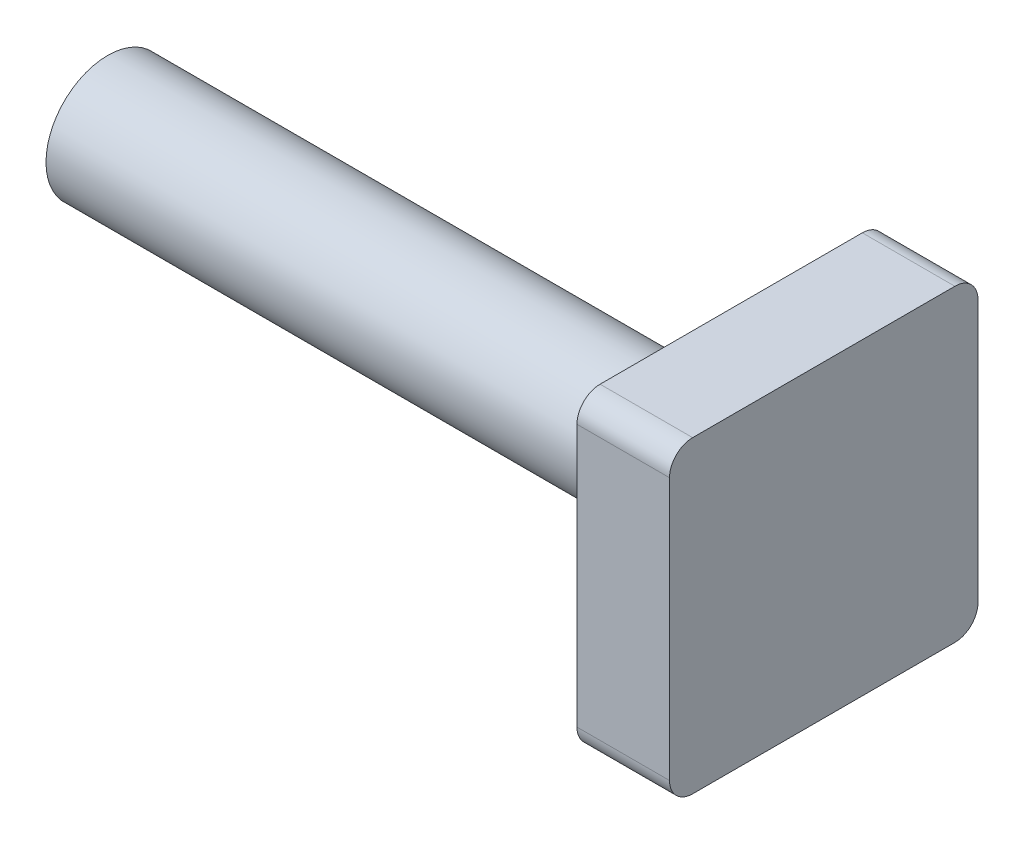
ISO-10303-21;
HEADER;
FILE_DESCRIPTION(('STEP AP214'),'2;1');
FILE_NAME('part.step','',(''),(''),'','','');
FILE_SCHEMA(('AUTOMOTIVE_DESIGN { 1 0 10303 214 1 1 1 1 }'));
ENDSEC;
DATA;
#1=APPLICATION_CONTEXT('core data for automotive mechanical design processes');
#2=APPLICATION_PROTOCOL_DEFINITION('international standard','automotive_design',2000,#1);
#3=PRODUCT_CONTEXT('',#1,'mechanical');
#4=PRODUCT('Part','Part','',(#3));
#5=PRODUCT_RELATED_PRODUCT_CATEGORY('part','',(#4));
#6=PRODUCT_DEFINITION_FORMATION('','',#4);
#7=PRODUCT_DEFINITION_CONTEXT('part definition',#1,'design');
#8=PRODUCT_DEFINITION('design','',#6,#7);
#9=PRODUCT_DEFINITION_SHAPE('','',#8);
#10=(LENGTH_UNIT() NAMED_UNIT(*) SI_UNIT(.MILLI.,.METRE.));
#11=(NAMED_UNIT(*) PLANE_ANGLE_UNIT() SI_UNIT($,.RADIAN.));
#12=(NAMED_UNIT(*) SI_UNIT($,.STERADIAN.) SOLID_ANGLE_UNIT());
#13=UNCERTAINTY_MEASURE_WITH_UNIT(LENGTH_MEASURE(1.E-05),#10,'distance_accuracy_value','');
#14=(GEOMETRIC_REPRESENTATION_CONTEXT(3) GLOBAL_UNCERTAINTY_ASSIGNED_CONTEXT((#13)) GLOBAL_UNIT_ASSIGNED_CONTEXT((#10,
#11,#12)) REPRESENTATION_CONTEXT('',''));
#15=CARTESIAN_POINT('',(0.,0.,0.));
#16=DIRECTION('',(0.,0.,1.));
#17=DIRECTION('',(1.,0.,0.));
#18=AXIS2_PLACEMENT_3D('',#15,#16,#17);
#19=CARTESIAN_POINT('',(0.,-5.,5.));
#20=DIRECTION('',(1.,0.,0.));
#21=DIRECTION('',(0.,0.,-1.));
#22=AXIS2_PLACEMENT_3D('',#19,#20,#21);
#23=PLANE('',#22);
#24=CARTESIAN_POINT('',(0.,0.,0.));
#25=DIRECTION('',(1.,0.,0.));
#26=DIRECTION('',(0.,0.,-1.));
#27=AXIS2_PLACEMENT_3D('',#24,#25,#26);
#28=CIRCLE('',#27,2.5);
#29=CARTESIAN_POINT('',(0.,0.,-2.5));
#30=VERTEX_POINT('',#29);
#31=EDGE_CURVE('E169',#30,#30,#28,.T.);
#32=ORIENTED_EDGE('',*,*,#31,.T.);
#33=EDGE_LOOP('',(#32));
#34=FACE_BOUND('',#33,.T.);
#35=DIRECTION('',(0.,0.,-1.));
#36=VECTOR('',#35,1.);
#37=CARTESIAN_POINT('',(0.,-5.,5.));
#38=LINE('',#37,#36);
#39=CARTESIAN_POINT('',(0.,-5.,4.25));
#40=VERTEX_POINT('',#39);
#41=CARTESIAN_POINT('',(0.,-5.,-4.25));
#42=VERTEX_POINT('',#41);
#43=EDGE_CURVE('E122',#40,#42,#38,.T.);
#44=ORIENTED_EDGE('',*,*,#43,.F.);
#45=CARTESIAN_POINT('',(0.,-4.25,4.25));
#46=DIRECTION('',(1.,0.,0.));
#47=DIRECTION('',(0.,0.,-1.));
#48=AXIS2_PLACEMENT_3D('',#45,#46,#47);
#49=CIRCLE('',#48,0.75);
#50=CARTESIAN_POINT('',(0.,-4.25,5.));
#51=VERTEX_POINT('',#50);
#52=EDGE_CURVE('E105',#40,#51,#49,.F.);
#53=ORIENTED_EDGE('',*,*,#52,.T.);
#54=DIRECTION('',(0.,-1.,0.));
#55=VECTOR('',#54,1.);
#56=CARTESIAN_POINT('',(0.,5.,5.));
#57=LINE('',#56,#55);
#58=CARTESIAN_POINT('',(0.,4.25,5.));
#59=VERTEX_POINT('',#58);
#60=EDGE_CURVE('E131',#59,#51,#57,.T.);
#61=ORIENTED_EDGE('',*,*,#60,.F.);
#62=CARTESIAN_POINT('',(0.,4.25,4.25));
#63=DIRECTION('',(1.,0.,0.));
#64=DIRECTION('',(0.,0.,-1.));
#65=AXIS2_PLACEMENT_3D('',#62,#63,#64);
#66=CIRCLE('',#65,0.75);
#67=CARTESIAN_POINT('',(0.,5.,4.25));
#68=VERTEX_POINT('',#67);
#69=EDGE_CURVE('E116',#59,#68,#66,.F.);
#70=ORIENTED_EDGE('',*,*,#69,.T.);
#71=DIRECTION('',(0.,0.,1.));
#72=VECTOR('',#71,1.);
#73=CARTESIAN_POINT('',(0.,5.,5.));
#74=LINE('',#73,#72);
#75=CARTESIAN_POINT('',(0.,5.,-4.25));
#76=VERTEX_POINT('',#75);
#77=EDGE_CURVE('E134',#76,#68,#74,.T.);
#78=ORIENTED_EDGE('',*,*,#77,.F.);
#79=CARTESIAN_POINT('',(0.,4.25,-4.25));
#80=DIRECTION('',(1.,0.,0.));
#81=DIRECTION('',(0.,0.,-1.));
#82=AXIS2_PLACEMENT_3D('',#79,#80,#81);
#83=CIRCLE('',#82,0.75);
#84=CARTESIAN_POINT('',(0.,4.25,-5.));
#85=VERTEX_POINT('',#84);
#86=EDGE_CURVE('E144',#76,#85,#83,.F.);
#87=ORIENTED_EDGE('',*,*,#86,.T.);
#88=DIRECTION('',(0.,1.,0.));
#89=VECTOR('',#88,1.);
#90=CARTESIAN_POINT('',(0.,5.,-5.));
#91=LINE('',#90,#89);
#92=CARTESIAN_POINT('',(0.,-4.25,-5.));
#93=VERTEX_POINT('',#92);
#94=EDGE_CURVE('E130',#93,#85,#91,.T.);
#95=ORIENTED_EDGE('',*,*,#94,.F.);
#96=CARTESIAN_POINT('',(0.,-4.25,-4.25));
#97=DIRECTION('',(1.,0.,0.));
#98=DIRECTION('',(0.,0.,-1.));
#99=AXIS2_PLACEMENT_3D('',#96,#97,#98);
#100=CIRCLE('',#99,0.75);
#101=EDGE_CURVE('E126',#93,#42,#100,.F.);
#102=ORIENTED_EDGE('',*,*,#101,.T.);
#103=EDGE_LOOP('',(#44,#53,#61,#70,#78,#87,#95,#102));
#104=FACE_BOUND('',#103,.T.);
#105=ADVANCED_FACE('F38',(#34,#104),#23,.F.);
#106=CARTESIAN_POINT('',(3.,5.,5.));
#107=DIRECTION('',(0.,0.,-1.));
#108=DIRECTION('',(-1.,0.,0.));
#109=AXIS2_PLACEMENT_3D('',#106,#107,#108);
#110=PLANE('',#109);
#111=ORIENTED_EDGE('',*,*,#60,.T.);
#112=DIRECTION('',(-1.,0.,0.));
#113=VECTOR('',#112,1.);
#114=CARTESIAN_POINT('',(3.,-4.25,5.));
#115=LINE('',#114,#113);
#116=CARTESIAN_POINT('',(3.,-4.25,5.));
#117=VERTEX_POINT('',#116);
#118=EDGE_CURVE('E110',#51,#117,#115,.F.);
#119=ORIENTED_EDGE('',*,*,#118,.T.);
#120=DIRECTION('',(0.,-1.,0.));
#121=VECTOR('',#120,1.);
#122=CARTESIAN_POINT('',(3.,5.,5.));
#123=LINE('',#122,#121);
#124=CARTESIAN_POINT('',(3.,4.25,5.));
#125=VERTEX_POINT('',#124);
#126=EDGE_CURVE('E140',#125,#117,#123,.T.);
#127=ORIENTED_EDGE('',*,*,#126,.F.);
#128=DIRECTION('',(-1.,0.,0.));
#129=VECTOR('',#128,1.);
#130=CARTESIAN_POINT('',(3.,4.25,5.));
#131=LINE('',#130,#129);
#132=EDGE_CURVE('E115',#125,#59,#131,.T.);
#133=ORIENTED_EDGE('',*,*,#132,.T.);
#134=EDGE_LOOP('',(#111,#119,#127,#133));
#135=FACE_BOUND('',#134,.T.);
#136=ADVANCED_FACE('F186',(#135),#110,.F.);
#137=CARTESIAN_POINT('',(3.,-5.,5.));
#138=DIRECTION('',(0.,1.,0.));
#139=DIRECTION('',(0.,0.,1.));
#140=AXIS2_PLACEMENT_3D('',#137,#138,#139);
#141=PLANE('',#140);
#142=DIRECTION('',(0.,0.,-1.));
#143=VECTOR('',#142,1.);
#144=CARTESIAN_POINT('',(3.,-5.,5.));
#145=LINE('',#144,#143);
#146=CARTESIAN_POINT('',(3.,-5.,4.25));
#147=VERTEX_POINT('',#146);
#148=CARTESIAN_POINT('',(3.,-5.,-4.25));
#149=VERTEX_POINT('',#148);
#150=EDGE_CURVE('E125',#147,#149,#145,.T.);
#151=ORIENTED_EDGE('',*,*,#150,.F.);
#152=DIRECTION('',(-1.,0.,0.));
#153=VECTOR('',#152,1.);
#154=CARTESIAN_POINT('',(3.,-5.,4.25));
#155=LINE('',#154,#153);
#156=EDGE_CURVE('E109',#147,#40,#155,.T.);
#157=ORIENTED_EDGE('',*,*,#156,.T.);
#158=ORIENTED_EDGE('',*,*,#43,.T.);
#159=DIRECTION('',(-1.,0.,0.));
#160=VECTOR('',#159,1.);
#161=CARTESIAN_POINT('',(3.,-5.,-4.25));
#162=LINE('',#161,#160);
#163=EDGE_CURVE('E127',#42,#149,#162,.F.);
#164=ORIENTED_EDGE('',*,*,#163,.T.);
#165=EDGE_LOOP('',(#151,#157,#158,#164));
#166=FACE_BOUND('',#165,.T.);
#167=ADVANCED_FACE('F121',(#166),#141,.F.);
#168=CARTESIAN_POINT('',(3.,5.,-5.));
#169=DIRECTION('',(0.,0.,1.));
#170=DIRECTION('',(1.,0.,0.));
#171=AXIS2_PLACEMENT_3D('',#168,#169,#170);
#172=PLANE('',#171);
#173=ORIENTED_EDGE('',*,*,#94,.T.);
#174=DIRECTION('',(-1.,0.,0.));
#175=VECTOR('',#174,1.);
#176=CARTESIAN_POINT('',(3.,4.25,-5.));
#177=LINE('',#176,#175);
#178=CARTESIAN_POINT('',(3.,4.25,-5.));
#179=VERTEX_POINT('',#178);
#180=EDGE_CURVE('E164',#85,#179,#177,.F.);
#181=ORIENTED_EDGE('',*,*,#180,.T.);
#182=DIRECTION('',(0.,1.,0.));
#183=VECTOR('',#182,1.);
#184=CARTESIAN_POINT('',(3.,5.,-5.));
#185=LINE('',#184,#183);
#186=CARTESIAN_POINT('',(3.,-4.25,-5.));
#187=VERTEX_POINT('',#186);
#188=EDGE_CURVE('E225',#187,#179,#185,.T.);
#189=ORIENTED_EDGE('',*,*,#188,.F.);
#190=DIRECTION('',(-1.,0.,0.));
#191=VECTOR('',#190,1.);
#192=CARTESIAN_POINT('',(3.,-4.25,-5.));
#193=LINE('',#192,#191);
#194=EDGE_CURVE('E161',#187,#93,#193,.T.);
#195=ORIENTED_EDGE('',*,*,#194,.T.);
#196=EDGE_LOOP('',(#173,#181,#189,#195));
#197=FACE_BOUND('',#196,.T.);
#198=ADVANCED_FACE('F201',(#197),#172,.F.);
#199=CARTESIAN_POINT('',(3.,5.,5.));
#200=DIRECTION('',(0.,-1.,0.));
#201=DIRECTION('',(0.,0.,-1.));
#202=AXIS2_PLACEMENT_3D('',#199,#200,#201);
#203=PLANE('',#202);
#204=ORIENTED_EDGE('',*,*,#77,.T.);
#205=DIRECTION('',(-1.,0.,0.));
#206=VECTOR('',#205,1.);
#207=CARTESIAN_POINT('',(3.,5.,4.25));
#208=LINE('',#207,#206);
#209=CARTESIAN_POINT('',(3.,5.,4.25));
#210=VERTEX_POINT('',#209);
#211=EDGE_CURVE('E53',#68,#210,#208,.F.);
#212=ORIENTED_EDGE('',*,*,#211,.T.);
#213=DIRECTION('',(0.,0.,1.));
#214=VECTOR('',#213,1.);
#215=CARTESIAN_POINT('',(3.,5.,5.));
#216=LINE('',#215,#214);
#217=CARTESIAN_POINT('',(3.,5.,-4.25));
#218=VERTEX_POINT('',#217);
#219=EDGE_CURVE('E141',#218,#210,#216,.T.);
#220=ORIENTED_EDGE('',*,*,#219,.F.);
#221=DIRECTION('',(-1.,0.,0.));
#222=VECTOR('',#221,1.);
#223=CARTESIAN_POINT('',(3.,5.,-4.25));
#224=LINE('',#223,#222);
#225=EDGE_CURVE('E157',#218,#76,#224,.T.);
#226=ORIENTED_EDGE('',*,*,#225,.T.);
#227=EDGE_LOOP('',(#204,#212,#220,#226));
#228=FACE_BOUND('',#227,.T.);
#229=ADVANCED_FACE('F198',(#228),#203,.F.);
#230=CARTESIAN_POINT('',(3.,-5.,5.));
#231=DIRECTION('',(1.,0.,0.));
#232=DIRECTION('',(0.,0.,-1.));
#233=AXIS2_PLACEMENT_3D('',#230,#231,#232);
#234=PLANE('',#233);
#235=ORIENTED_EDGE('',*,*,#126,.T.);
#236=CARTESIAN_POINT('',(3.,-4.25,4.25));
#237=DIRECTION('',(1.,0.,0.));
#238=DIRECTION('',(0.,0.,-1.));
#239=AXIS2_PLACEMENT_3D('',#236,#237,#238);
#240=CIRCLE('',#239,0.75);
#241=EDGE_CURVE('E155',#117,#147,#240,.T.);
#242=ORIENTED_EDGE('',*,*,#241,.T.);
#243=ORIENTED_EDGE('',*,*,#150,.T.);
#244=CARTESIAN_POINT('',(3.,-4.25,-4.25));
#245=DIRECTION('',(1.,0.,0.));
#246=DIRECTION('',(0.,0.,-1.));
#247=AXIS2_PLACEMENT_3D('',#244,#245,#246);
#248=CIRCLE('',#247,0.75);
#249=EDGE_CURVE('E150',#149,#187,#248,.T.);
#250=ORIENTED_EDGE('',*,*,#249,.T.);
#251=ORIENTED_EDGE('',*,*,#188,.T.);
#252=CARTESIAN_POINT('',(3.,4.25,-4.25));
#253=DIRECTION('',(1.,0.,0.));
#254=DIRECTION('',(0.,0.,-1.));
#255=AXIS2_PLACEMENT_3D('',#252,#253,#254);
#256=CIRCLE('',#255,0.75);
#257=EDGE_CURVE('E60',#179,#218,#256,.T.);
#258=ORIENTED_EDGE('',*,*,#257,.T.);
#259=ORIENTED_EDGE('',*,*,#219,.T.);
#260=CARTESIAN_POINT('',(3.,4.25,4.25));
#261=DIRECTION('',(1.,0.,0.));
#262=DIRECTION('',(0.,0.,-1.));
#263=AXIS2_PLACEMENT_3D('',#260,#261,#262);
#264=CIRCLE('',#263,0.75);
#265=EDGE_CURVE('E153',#210,#125,#264,.T.);
#266=ORIENTED_EDGE('',*,*,#265,.T.);
#267=EDGE_LOOP('',(#235,#242,#243,#250,#251,#258,#259,#266));
#268=FACE_BOUND('',#267,.T.);
#269=ADVANCED_FACE('F196',(#268),#234,.T.);
#270=CARTESIAN_POINT('',(-20.5,0.,0.));
#271=DIRECTION('',(1.,0.,0.));
#272=DIRECTION('',(0.,0.,-1.));
#273=AXIS2_PLACEMENT_3D('',#270,#271,#272);
#274=CYLINDRICAL_SURFACE('',#273,2.);
#275=CARTESIAN_POINT('',(-20.2113248654052,0.,0.));
#276=DIRECTION('',(-1.,0.,0.));
#277=DIRECTION('',(0.,0.,1.));
#278=AXIS2_PLACEMENT_3D('',#275,#276,#277);
#279=CIRCLE('',#278,2.);
#280=CARTESIAN_POINT('',(-20.2113248654052,0.,2.));
#281=VERTEX_POINT('',#280);
#282=EDGE_CURVE('E11',#281,#281,#279,.F.);
#283=ORIENTED_EDGE('',*,*,#282,.T.);
#284=EDGE_LOOP('',(#283));
#285=FACE_BOUND('',#284,.T.);
#286=CARTESIAN_POINT('',(-0.5,0.,0.));
#287=DIRECTION('',(1.,0.,0.));
#288=DIRECTION('',(0.,0.,-1.));
#289=AXIS2_PLACEMENT_3D('',#286,#287,#288);
#290=CIRCLE('',#289,2.);
#291=CARTESIAN_POINT('',(-0.5,0.,-2.));
#292=VERTEX_POINT('',#291);
#293=EDGE_CURVE('E166',#292,#292,#290,.F.);
#294=ORIENTED_EDGE('',*,*,#293,.T.);
#295=EDGE_LOOP('',(#294));
#296=FACE_BOUND('',#295,.T.);
#297=ADVANCED_FACE('F236',(#285,#296),#274,.T.);
#298=CARTESIAN_POINT('',(-20.5,0.,0.));
#299=DIRECTION('',(-1.,0.,0.));
#300=DIRECTION('',(0.,0.,1.));
#301=AXIS2_PLACEMENT_3D('',#298,#299,#300);
#302=PLANE('',#301);
#303=CARTESIAN_POINT('',(-20.5,0.,0.));
#304=DIRECTION('',(-1.,0.,0.));
#305=DIRECTION('',(0.,0.,1.));
#306=AXIS2_PLACEMENT_3D('',#303,#304,#305);
#307=CIRCLE('',#306,1.49999999999999);
#308=CARTESIAN_POINT('',(-20.5,0.,1.49999999999999));
#309=VERTEX_POINT('',#308);
#310=EDGE_CURVE('E46',#309,#309,#307,.T.);
#311=ORIENTED_EDGE('',*,*,#310,.T.);
#312=EDGE_LOOP('',(#311));
#313=FACE_BOUND('',#312,.T.);
#314=ADVANCED_FACE('F174',(#313),#302,.T.);
#315=CARTESIAN_POINT('',(3.,-4.25,4.25));
#316=DIRECTION('',(-1.,0.,0.));
#317=DIRECTION('',(0.,0.,1.));
#318=AXIS2_PLACEMENT_3D('',#315,#316,#317);
#319=CYLINDRICAL_SURFACE('',#318,0.75);
#320=ORIENTED_EDGE('',*,*,#241,.F.);
#321=ORIENTED_EDGE('',*,*,#118,.F.);
#322=ORIENTED_EDGE('',*,*,#52,.F.);
#323=ORIENTED_EDGE('',*,*,#156,.F.);
#324=EDGE_LOOP('',(#320,#321,#322,#323));
#325=FACE_BOUND('',#324,.T.);
#326=ADVANCED_FACE('F108',(#325),#319,.T.);
#327=CARTESIAN_POINT('',(3.,4.25,4.25));
#328=DIRECTION('',(-1.,0.,0.));
#329=DIRECTION('',(0.,0.,1.));
#330=AXIS2_PLACEMENT_3D('',#327,#328,#329);
#331=CYLINDRICAL_SURFACE('',#330,0.75);
#332=ORIENTED_EDGE('',*,*,#265,.F.);
#333=ORIENTED_EDGE('',*,*,#211,.F.);
#334=ORIENTED_EDGE('',*,*,#69,.F.);
#335=ORIENTED_EDGE('',*,*,#132,.F.);
#336=EDGE_LOOP('',(#332,#333,#334,#335));
#337=FACE_BOUND('',#336,.T.);
#338=ADVANCED_FACE('F209',(#337),#331,.T.);
#339=CARTESIAN_POINT('',(3.,4.25,-4.25));
#340=DIRECTION('',(-1.,0.,0.));
#341=DIRECTION('',(0.,0.,1.));
#342=AXIS2_PLACEMENT_3D('',#339,#340,#341);
#343=CYLINDRICAL_SURFACE('',#342,0.75);
#344=ORIENTED_EDGE('',*,*,#257,.F.);
#345=ORIENTED_EDGE('',*,*,#180,.F.);
#346=ORIENTED_EDGE('',*,*,#86,.F.);
#347=ORIENTED_EDGE('',*,*,#225,.F.);
#348=EDGE_LOOP('',(#344,#345,#346,#347));
#349=FACE_BOUND('',#348,.T.);
#350=ADVANCED_FACE('F212',(#349),#343,.T.);
#351=CARTESIAN_POINT('',(3.,-4.25,-4.25));
#352=DIRECTION('',(-1.,0.,0.));
#353=DIRECTION('',(0.,0.,1.));
#354=AXIS2_PLACEMENT_3D('',#351,#352,#353);
#355=CYLINDRICAL_SURFACE('',#354,0.75);
#356=ORIENTED_EDGE('',*,*,#249,.F.);
#357=ORIENTED_EDGE('',*,*,#163,.F.);
#358=ORIENTED_EDGE('',*,*,#101,.F.);
#359=ORIENTED_EDGE('',*,*,#194,.F.);
#360=EDGE_LOOP('',(#356,#357,#358,#359));
#361=FACE_BOUND('',#360,.T.);
#362=ADVANCED_FACE('F182',(#361),#355,.T.);
#363=CARTESIAN_POINT('',(-0.5,0.,0.));
#364=DIRECTION('',(1.,0.,0.));
#365=DIRECTION('',(0.,0.,-1.));
#366=AXIS2_PLACEMENT_3D('',#363,#364,#365);
#367=TOROIDAL_SURFACE('',#366,2.5,0.5);
#368=ORIENTED_EDGE('',*,*,#31,.F.);
#369=EDGE_LOOP('',(#368));
#370=FACE_BOUND('',#369,.T.);
#371=ORIENTED_EDGE('',*,*,#293,.F.);
#372=EDGE_LOOP('',(#371));
#373=FACE_BOUND('',#372,.T.);
#374=ADVANCED_FACE('F177',(#370,#373),#367,.F.);
#375=CARTESIAN_POINT('',(-20.5,0.,0.));
#376=DIRECTION('',(1.,0.,0.));
#377=DIRECTION('',(0.,0.,-1.));
#378=AXIS2_PLACEMENT_3D('',#375,#376,#377);
#379=CONICAL_SURFACE('',#378,1.49999999999999,1.04719755119661);
#380=ORIENTED_EDGE('',*,*,#282,.F.);
#381=EDGE_LOOP('',(#380));
#382=FACE_BOUND('',#381,.T.);
#383=ORIENTED_EDGE('',*,*,#310,.F.);
#384=EDGE_LOOP('',(#383));
#385=FACE_BOUND('',#384,.T.);
#386=ADVANCED_FACE('F40',(#382,#385),#379,.T.);
#387=CLOSED_SHELL('',(#105,#136,#167,#198,#229,#269,#297,#314,#326,#338,#350,#362,#374,#386));
#388=MANIFOLD_SOLID_BREP('B2',#387);
#389=ADVANCED_BREP_SHAPE_REPRESENTATION('',(#18,#388),#14);
#390=SHAPE_DEFINITION_REPRESENTATION(#9,#389);
ENDSEC;
END-ISO-10303-21;
